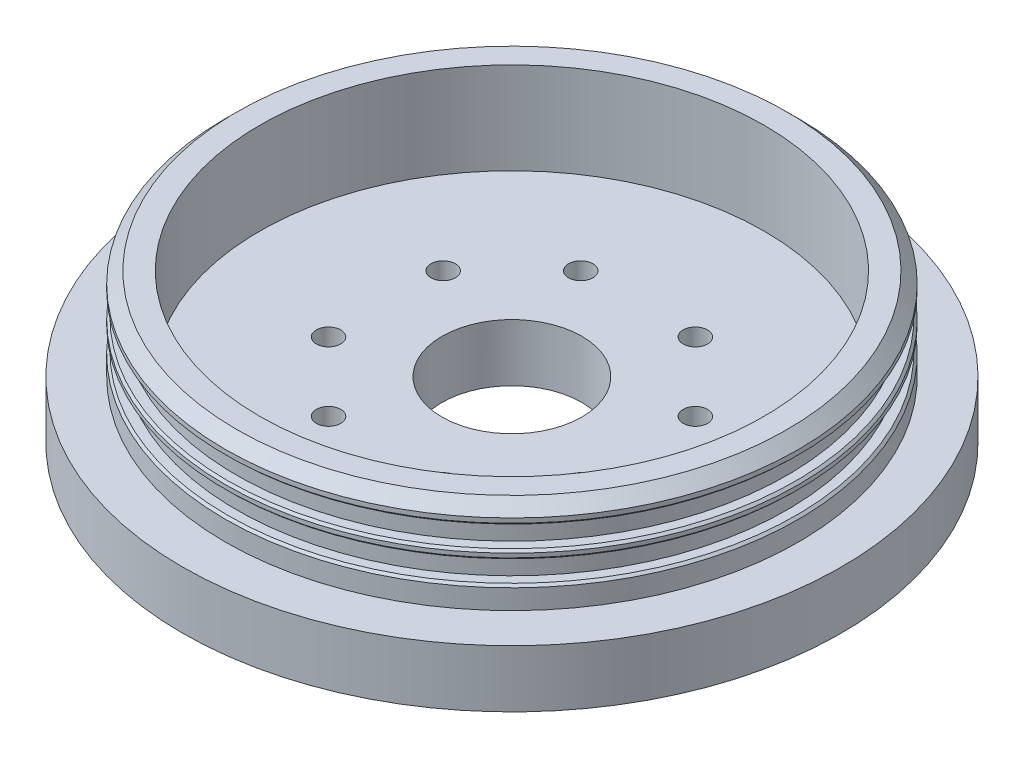
ISO-10303-21;
HEADER;
FILE_DESCRIPTION(('STEP AP214'),'2;1');
FILE_NAME('part.step','',(''),(''),'','','');
FILE_SCHEMA(('AUTOMOTIVE_DESIGN { 1 0 10303 214 1 1 1 1 }'));
ENDSEC;
DATA;
#1=APPLICATION_CONTEXT('core data for automotive mechanical design processes');
#2=APPLICATION_PROTOCOL_DEFINITION('international standard','automotive_design',2000,#1);
#3=PRODUCT_CONTEXT('',#1,'mechanical');
#4=PRODUCT('Part','Part','',(#3));
#5=PRODUCT_RELATED_PRODUCT_CATEGORY('part','',(#4));
#6=PRODUCT_DEFINITION_FORMATION('','',#4);
#7=PRODUCT_DEFINITION_CONTEXT('part definition',#1,'design');
#8=PRODUCT_DEFINITION('design','',#6,#7);
#9=PRODUCT_DEFINITION_SHAPE('','',#8);
#10=(LENGTH_UNIT() NAMED_UNIT(*) SI_UNIT(.MILLI.,.METRE.));
#11=(NAMED_UNIT(*) PLANE_ANGLE_UNIT() SI_UNIT($,.RADIAN.));
#12=(NAMED_UNIT(*) SI_UNIT($,.STERADIAN.) SOLID_ANGLE_UNIT());
#13=UNCERTAINTY_MEASURE_WITH_UNIT(LENGTH_MEASURE(1.E-05),#10,'distance_accuracy_value','');
#14=(GEOMETRIC_REPRESENTATION_CONTEXT(3) GLOBAL_UNCERTAINTY_ASSIGNED_CONTEXT((#13)) GLOBAL_UNIT_ASSIGNED_CONTEXT((#10,
#11,#12)) REPRESENTATION_CONTEXT('',''));
#15=CARTESIAN_POINT('',(0.,0.,0.));
#16=DIRECTION('',(0.,0.,1.));
#17=DIRECTION('',(1.,0.,0.));
#18=AXIS2_PLACEMENT_3D('',#15,#16,#17);
#19=CARTESIAN_POINT('',(0.,13.335,0.));
#20=DIRECTION('',(0.,-1.,0.));
#21=DIRECTION('',(0.,0.,-1.));
#22=AXIS2_PLACEMENT_3D('',#19,#20,#21);
#23=CYLINDRICAL_SURFACE('',#22,31.75);
#24=CARTESIAN_POINT('',(0.,8.2350684242944,0.));
#25=DIRECTION('',(0.,-1.,0.));
#26=DIRECTION('',(0.,0.,-1.));
#27=AXIS2_PLACEMENT_3D('',#24,#25,#26);
#28=CIRCLE('',#27,31.75);
#29=CARTESIAN_POINT('',(0.,8.2350684242944,-31.75));
#30=VERTEX_POINT('',#29);
#31=EDGE_CURVE('E42',#30,#30,#28,.F.);
#32=ORIENTED_EDGE('',*,*,#31,.T.);
#33=EDGE_LOOP('',(#32));
#34=FACE_BOUND('',#33,.T.);
#35=CARTESIAN_POINT('',(0.,8.68721080125111,0.));
#36=DIRECTION('',(0.,1.,0.));
#37=DIRECTION('',(0.,0.,1.));
#38=AXIS2_PLACEMENT_3D('',#35,#36,#37);
#39=CIRCLE('',#38,31.75);
#40=CARTESIAN_POINT('',(0.,8.68721080125111,31.75));
#41=VERTEX_POINT('',#40);
#42=EDGE_CURVE('E178',#41,#41,#39,.F.);
#43=ORIENTED_EDGE('',*,*,#42,.T.);
#44=EDGE_LOOP('',(#43));
#45=FACE_BOUND('',#44,.T.);
#46=ADVANCED_FACE('F34',(#34,#45),#23,.T.);
#47=CARTESIAN_POINT('',(0.,8.9412108012511,31.75));
#48=DIRECTION('',(0.,1.,0.));
#49=DIRECTION('',(0.,0.,1.));
#50=AXIS2_PLACEMENT_3D('',#47,#48,#49);
#51=PLANE('',#50);
#52=CARTESIAN_POINT('',(0.,8.9412108012511,0.));
#53=DIRECTION('',(0.,1.,0.));
#54=DIRECTION('',(0.,0.,1.));
#55=AXIS2_PLACEMENT_3D('',#52,#53,#54);
#56=CIRCLE('',#55,31.496);
#57=CARTESIAN_POINT('',(0.,8.9412108012511,31.496));
#58=VERTEX_POINT('',#57);
#59=EDGE_CURVE('E11',#58,#58,#56,.T.);
#60=ORIENTED_EDGE('',*,*,#59,.T.);
#61=EDGE_LOOP('',(#60));
#62=FACE_BOUND('',#61,.T.);
#63=CARTESIAN_POINT('',(0.,8.9412108012511,0.));
#64=DIRECTION('',(0.,-1.,0.));
#65=DIRECTION('',(0.,0.,-1.));
#66=AXIS2_PLACEMENT_3D('',#63,#64,#65);
#67=CIRCLE('',#66,30.48);
#68=CARTESIAN_POINT('',(0.,8.9412108012511,-30.48));
#69=VERTEX_POINT('',#68);
#70=EDGE_CURVE('E143',#69,#69,#67,.T.);
#71=ORIENTED_EDGE('',*,*,#70,.T.);
#72=EDGE_LOOP('',(#71));
#73=FACE_BOUND('',#72,.T.);
#74=ADVANCED_FACE('F218',(#62,#73),#51,.T.);
#75=CARTESIAN_POINT('',(0.,-3.175,0.));
#76=DIRECTION('',(0.,-1.,0.));
#77=DIRECTION('',(0.,0.,-1.));
#78=AXIS2_PLACEMENT_3D('',#75,#76,#77);
#79=CYLINDRICAL_SURFACE('',#78,30.48);
#80=CARTESIAN_POINT('',(0.,11.3034108012511,0.));
#81=DIRECTION('',(0.,-1.,0.));
#82=DIRECTION('',(0.,0.,-1.));
#83=AXIS2_PLACEMENT_3D('',#80,#81,#82);
#84=CIRCLE('',#83,30.48);
#85=CARTESIAN_POINT('',(0.,11.3034108012511,-30.48));
#86=VERTEX_POINT('',#85);
#87=EDGE_CURVE('E140',#86,#86,#84,.T.);
#88=ORIENTED_EDGE('',*,*,#87,.T.);
#89=EDGE_LOOP('',(#88));
#90=FACE_BOUND('',#89,.T.);
#91=ORIENTED_EDGE('',*,*,#70,.F.);
#92=EDGE_LOOP('',(#91));
#93=FACE_BOUND('',#92,.T.);
#94=ADVANCED_FACE('F222',(#90,#93),#79,.T.);
#95=CARTESIAN_POINT('',(0.,11.3034108012511,31.75));
#96=DIRECTION('',(0.,-1.,0.));
#97=DIRECTION('',(0.,0.,-1.));
#98=AXIS2_PLACEMENT_3D('',#95,#96,#97);
#99=PLANE('',#98);
#100=CARTESIAN_POINT('',(0.,11.3034108012511,0.));
#101=DIRECTION('',(0.,-1.,0.));
#102=DIRECTION('',(0.,0.,-1.));
#103=AXIS2_PLACEMENT_3D('',#100,#101,#102);
#104=CIRCLE('',#103,31.496);
#105=CARTESIAN_POINT('',(0.,11.3034108012511,-31.496));
#106=VERTEX_POINT('',#105);
#107=EDGE_CURVE('E161',#106,#106,#104,.T.);
#108=ORIENTED_EDGE('',*,*,#107,.T.);
#109=EDGE_LOOP('',(#108));
#110=FACE_BOUND('',#109,.T.);
#111=ORIENTED_EDGE('',*,*,#87,.F.);
#112=EDGE_LOOP('',(#111));
#113=FACE_BOUND('',#112,.T.);
#114=ADVANCED_FACE('F309',(#110,#113),#99,.T.);
#115=CARTESIAN_POINT('',(0.,13.335,0.));
#116=DIRECTION('',(0.,1.,0.));
#117=DIRECTION('',(0.,0.,1.));
#118=AXIS2_PLACEMENT_3D('',#115,#116,#117);
#119=PLANE('',#118);
#120=CARTESIAN_POINT('',(0.,13.335,0.));
#121=DIRECTION('',(0.,1.,0.));
#122=DIRECTION('',(0.,0.,1.));
#123=AXIS2_PLACEMENT_3D('',#120,#121,#122);
#124=CIRCLE('',#123,30.48);
#125=CARTESIAN_POINT('',(0.,13.335,30.48));
#126=VERTEX_POINT('',#125);
#127=EDGE_CURVE('E155',#126,#126,#124,.T.);
#128=ORIENTED_EDGE('',*,*,#127,.T.);
#129=EDGE_LOOP('',(#128));
#130=FACE_BOUND('',#129,.T.);
#131=CARTESIAN_POINT('',(0.,13.335,0.));
#132=DIRECTION('',(0.,1.,0.));
#133=DIRECTION('',(0.,0.,1.));
#134=AXIS2_PLACEMENT_3D('',#131,#132,#133);
#135=CIRCLE('',#134,27.94);
#136=CARTESIAN_POINT('',(0.,13.335,27.94));
#137=VERTEX_POINT('',#136);
#138=EDGE_CURVE('E132',#137,#137,#135,.T.);
#139=ORIENTED_EDGE('',*,*,#138,.F.);
#140=EDGE_LOOP('',(#139));
#141=FACE_BOUND('',#140,.T.);
#142=ADVANCED_FACE('F212',(#130,#141),#119,.T.);
#143=CARTESIAN_POINT('',(0.,11.5574108012511,0.));
#144=DIRECTION('',(0.,-1.,0.));
#145=DIRECTION('',(0.,0.,-1.));
#146=AXIS2_PLACEMENT_3D('',#143,#144,#145);
#147=CIRCLE('',#146,31.75);
#148=CARTESIAN_POINT('',(0.,11.5574108012511,-31.75));
#149=VERTEX_POINT('',#148);
#150=EDGE_CURVE('E166',#149,#149,#147,.F.);
#151=ORIENTED_EDGE('',*,*,#150,.T.);
#152=EDGE_LOOP('',(#151));
#153=FACE_BOUND('',#152,.T.);
#154=CARTESIAN_POINT('',(0.,12.065,0.));
#155=DIRECTION('',(0.,1.,0.));
#156=DIRECTION('',(0.,0.,1.));
#157=AXIS2_PLACEMENT_3D('',#154,#155,#156);
#158=CIRCLE('',#157,31.75);
#159=CARTESIAN_POINT('',(0.,12.065,31.75));
#160=VERTEX_POINT('',#159);
#161=EDGE_CURVE('E158',#160,#160,#158,.F.);
#162=ORIENTED_EDGE('',*,*,#161,.T.);
#163=EDGE_LOOP('',(#162));
#164=FACE_BOUND('',#163,.T.);
#165=ADVANCED_FACE('F206',(#153,#164),#23,.T.);
#166=CARTESIAN_POINT('',(0.,5.61886842429443,31.75));
#167=DIRECTION('',(0.,1.,0.));
#168=DIRECTION('',(0.,0.,1.));
#169=AXIS2_PLACEMENT_3D('',#166,#167,#168);
#170=PLANE('',#169);
#171=CARTESIAN_POINT('',(0.,5.61886842429443,0.));
#172=DIRECTION('',(0.,1.,0.));
#173=DIRECTION('',(0.,0.,1.));
#174=AXIS2_PLACEMENT_3D('',#171,#172,#173);
#175=CIRCLE('',#174,31.496);
#176=CARTESIAN_POINT('',(0.,5.61886842429443,31.496));
#177=VERTEX_POINT('',#176);
#178=EDGE_CURVE('E172',#177,#177,#175,.T.);
#179=ORIENTED_EDGE('',*,*,#178,.T.);
#180=EDGE_LOOP('',(#179));
#181=FACE_BOUND('',#180,.T.);
#182=CARTESIAN_POINT('',(0.,5.61886842429443,0.));
#183=DIRECTION('',(0.,-1.,0.));
#184=DIRECTION('',(0.,0.,-1.));
#185=AXIS2_PLACEMENT_3D('',#182,#183,#184);
#186=CIRCLE('',#185,30.48);
#187=CARTESIAN_POINT('',(0.,5.61886842429443,-30.48));
#188=VERTEX_POINT('',#187);
#189=EDGE_CURVE('E137',#188,#188,#186,.T.);
#190=ORIENTED_EDGE('',*,*,#189,.T.);
#191=EDGE_LOOP('',(#190));
#192=FACE_BOUND('',#191,.T.);
#193=ADVANCED_FACE('F201',(#181,#192),#170,.T.);
#194=CARTESIAN_POINT('',(0.,-3.175,0.));
#195=DIRECTION('',(0.,-1.,0.));
#196=DIRECTION('',(0.,0.,-1.));
#197=AXIS2_PLACEMENT_3D('',#194,#195,#196);
#198=CYLINDRICAL_SURFACE('',#197,30.48);
#199=CARTESIAN_POINT('',(0.,7.98106842429442,0.));
#200=DIRECTION('',(0.,-1.,0.));
#201=DIRECTION('',(0.,0.,-1.));
#202=AXIS2_PLACEMENT_3D('',#199,#200,#201);
#203=CIRCLE('',#202,30.48);
#204=CARTESIAN_POINT('',(0.,7.98106842429442,-30.48));
#205=VERTEX_POINT('',#204);
#206=EDGE_CURVE('E131',#205,#205,#203,.T.);
#207=ORIENTED_EDGE('',*,*,#206,.T.);
#208=EDGE_LOOP('',(#207));
#209=FACE_BOUND('',#208,.T.);
#210=ORIENTED_EDGE('',*,*,#189,.F.);
#211=EDGE_LOOP('',(#210));
#212=FACE_BOUND('',#211,.T.);
#213=ADVANCED_FACE('F195',(#209,#212),#198,.T.);
#214=CARTESIAN_POINT('',(0.,7.98106842429442,31.75));
#215=DIRECTION('',(0.,-1.,0.));
#216=DIRECTION('',(0.,0.,-1.));
#217=AXIS2_PLACEMENT_3D('',#214,#215,#216);
#218=PLANE('',#217);
#219=CARTESIAN_POINT('',(0.,7.98106842429442,0.));
#220=DIRECTION('',(0.,-1.,0.));
#221=DIRECTION('',(0.,0.,-1.));
#222=AXIS2_PLACEMENT_3D('',#219,#220,#221);
#223=CIRCLE('',#222,31.496);
#224=CARTESIAN_POINT('',(0.,7.98106842429442,-31.496));
#225=VERTEX_POINT('',#224);
#226=EDGE_CURVE('E175',#225,#225,#223,.T.);
#227=ORIENTED_EDGE('',*,*,#226,.T.);
#228=EDGE_LOOP('',(#227));
#229=FACE_BOUND('',#228,.T.);
#230=ORIENTED_EDGE('',*,*,#206,.F.);
#231=EDGE_LOOP('',(#230));
#232=FACE_BOUND('',#231,.T.);
#233=ADVANCED_FACE('F191',(#229,#232),#218,.T.);
#234=CARTESIAN_POINT('',(0.,-3.175,0.));
#235=DIRECTION('',(0.,1.,0.));
#236=DIRECTION('',(0.,0.,1.));
#237=AXIS2_PLACEMENT_3D('',#234,#235,#236);
#238=PLANE('',#237);
#239=CARTESIAN_POINT('',(0.,-3.175,0.));
#240=DIRECTION('',(0.,-1.,0.));
#241=DIRECTION('',(0.,0.,-1.));
#242=AXIS2_PLACEMENT_3D('',#239,#240,#241);
#243=CIRCLE('',#242,7.74999999999996);
#244=CARTESIAN_POINT('',(0.,-3.175,-7.74999999999996));
#245=VERTEX_POINT('',#244);
#246=EDGE_CURVE('E124',#245,#245,#243,.T.);
#247=ORIENTED_EDGE('',*,*,#246,.F.);
#248=EDGE_LOOP('',(#247));
#249=FACE_BOUND('',#248,.T.);
#250=CARTESIAN_POINT('',(0.,-3.175,0.));
#251=DIRECTION('',(0.,1.,0.));
#252=DIRECTION('',(0.,0.,1.));
#253=AXIS2_PLACEMENT_3D('',#250,#251,#252);
#254=CIRCLE('',#253,36.5125);
#255=CARTESIAN_POINT('',(0.,-3.175,36.5125));
#256=VERTEX_POINT('',#255);
#257=EDGE_CURVE('E149',#256,#256,#254,.T.);
#258=ORIENTED_EDGE('',*,*,#257,.F.);
#259=EDGE_LOOP('',(#258));
#260=FACE_BOUND('',#259,.T.);
#261=ADVANCED_FACE('F194',(#249,#260),#238,.F.);
#262=CARTESIAN_POINT('',(0.,3.175,0.));
#263=DIRECTION('',(0.,-1.,0.));
#264=DIRECTION('',(0.,0.,-1.));
#265=AXIS2_PLACEMENT_3D('',#262,#263,#264);
#266=CYLINDRICAL_SURFACE('',#265,36.5125);
#267=CARTESIAN_POINT('',(0.,3.175,0.));
#268=DIRECTION('',(0.,1.,0.));
#269=DIRECTION('',(0.,0.,1.));
#270=AXIS2_PLACEMENT_3D('',#267,#268,#269);
#271=CIRCLE('',#270,36.5125);
#272=CARTESIAN_POINT('',(0.,3.175,36.5125));
#273=VERTEX_POINT('',#272);
#274=EDGE_CURVE('E152',#273,#273,#271,.T.);
#275=ORIENTED_EDGE('',*,*,#274,.F.);
#276=EDGE_LOOP('',(#275));
#277=FACE_BOUND('',#276,.T.);
#278=ORIENTED_EDGE('',*,*,#257,.T.);
#279=EDGE_LOOP('',(#278));
#280=FACE_BOUND('',#279,.T.);
#281=ADVANCED_FACE('F238',(#277,#280),#266,.T.);
#282=CARTESIAN_POINT('',(0.,3.175,0.));
#283=DIRECTION('',(0.,1.,0.));
#284=DIRECTION('',(0.,0.,1.));
#285=AXIS2_PLACEMENT_3D('',#282,#283,#284);
#286=PLANE('',#285);
#287=ORIENTED_EDGE('',*,*,#274,.T.);
#288=EDGE_LOOP('',(#287));
#289=FACE_BOUND('',#288,.T.);
#290=CARTESIAN_POINT('',(0.,3.175,0.));
#291=DIRECTION('',(0.,1.,0.));
#292=DIRECTION('',(0.,0.,1.));
#293=AXIS2_PLACEMENT_3D('',#290,#291,#292);
#294=CIRCLE('',#293,31.75);
#295=CARTESIAN_POINT('',(0.,3.175,31.75));
#296=VERTEX_POINT('',#295);
#297=EDGE_CURVE('E146',#296,#296,#294,.T.);
#298=ORIENTED_EDGE('',*,*,#297,.F.);
#299=EDGE_LOOP('',(#298));
#300=FACE_BOUND('',#299,.T.);
#301=ADVANCED_FACE('F229',(#289,#300),#286,.T.);
#302=CARTESIAN_POINT('',(0.,5.36486842429443,0.));
#303=DIRECTION('',(0.,1.,0.));
#304=DIRECTION('',(0.,0.,1.));
#305=AXIS2_PLACEMENT_3D('',#302,#303,#304);
#306=CIRCLE('',#305,31.75);
#307=CARTESIAN_POINT('',(0.,5.36486842429443,31.75));
#308=VERTEX_POINT('',#307);
#309=EDGE_CURVE('E169',#308,#308,#306,.F.);
#310=ORIENTED_EDGE('',*,*,#309,.T.);
#311=EDGE_LOOP('',(#310));
#312=FACE_BOUND('',#311,.T.);
#313=ORIENTED_EDGE('',*,*,#297,.T.);
#314=EDGE_LOOP('',(#313));
#315=FACE_BOUND('',#314,.T.);
#316=ADVANCED_FACE('F215',(#312,#315),#23,.T.);
#317=CARTESIAN_POINT('',(0.,3.175,0.));
#318=DIRECTION('',(0.,1.,0.));
#319=DIRECTION('',(0.,0.,1.));
#320=AXIS2_PLACEMENT_3D('',#317,#318,#319);
#321=CYLINDRICAL_SURFACE('',#320,27.94);
#322=CARTESIAN_POINT('',(0.,3.175,0.));
#323=DIRECTION('',(0.,1.,0.));
#324=DIRECTION('',(0.,0.,1.));
#325=AXIS2_PLACEMENT_3D('',#322,#323,#324);
#326=CIRCLE('',#325,27.94);
#327=CARTESIAN_POINT('',(0.,3.175,27.94));
#328=VERTEX_POINT('',#327);
#329=EDGE_CURVE('E128',#328,#328,#326,.T.);
#330=ORIENTED_EDGE('',*,*,#329,.F.);
#331=EDGE_LOOP('',(#330));
#332=FACE_BOUND('',#331,.T.);
#333=ORIENTED_EDGE('',*,*,#138,.T.);
#334=EDGE_LOOP('',(#333));
#335=FACE_BOUND('',#334,.T.);
#336=ADVANCED_FACE('F228',(#332,#335),#321,.F.);
#337=CARTESIAN_POINT('',(0.,3.175,0.));
#338=DIRECTION('',(0.,1.,0.));
#339=DIRECTION('',(0.,0.,1.));
#340=AXIS2_PLACEMENT_3D('',#337,#338,#339);
#341=PLANE('',#340);
#342=CARTESIAN_POINT('',(-6.35,3.175,13.97));
#343=DIRECTION('',(0.,1.,0.));
#344=DIRECTION('',(0.,0.,1.));
#345=AXIS2_PLACEMENT_3D('',#342,#343,#344);
#346=CIRCLE('',#345,1.35255);
#347=CARTESIAN_POINT('',(-6.35,3.175,15.32255));
#348=VERTEX_POINT('',#347);
#349=EDGE_CURVE('E78',#348,#348,#346,.T.);
#350=ORIENTED_EDGE('',*,*,#349,.F.);
#351=EDGE_LOOP('',(#350));
#352=FACE_BOUND('',#351,.T.);
#353=CARTESIAN_POINT('',(6.35,3.175,13.97));
#354=DIRECTION('',(0.,1.,0.));
#355=DIRECTION('',(0.,0.,1.));
#356=AXIS2_PLACEMENT_3D('',#353,#354,#355);
#357=CIRCLE('',#356,1.35255);
#358=CARTESIAN_POINT('',(6.35,3.175,15.32255));
#359=VERTEX_POINT('',#358);
#360=EDGE_CURVE('E77',#359,#359,#357,.T.);
#361=ORIENTED_EDGE('',*,*,#360,.F.);
#362=EDGE_LOOP('',(#361));
#363=FACE_BOUND('',#362,.T.);
#364=CARTESIAN_POINT('',(13.97,3.175,6.35));
#365=DIRECTION('',(0.,1.,0.));
#366=DIRECTION('',(0.,0.,1.));
#367=AXIS2_PLACEMENT_3D('',#364,#365,#366);
#368=CIRCLE('',#367,1.35255);
#369=CARTESIAN_POINT('',(13.97,3.175,7.70255));
#370=VERTEX_POINT('',#369);
#371=EDGE_CURVE('E88',#370,#370,#368,.T.);
#372=ORIENTED_EDGE('',*,*,#371,.F.);
#373=EDGE_LOOP('',(#372));
#374=FACE_BOUND('',#373,.T.);
#375=CARTESIAN_POINT('',(13.97,3.175,-6.35));
#376=DIRECTION('',(0.,1.,0.));
#377=DIRECTION('',(0.,0.,1.));
#378=AXIS2_PLACEMENT_3D('',#375,#376,#377);
#379=CIRCLE('',#378,1.35255);
#380=CARTESIAN_POINT('',(13.97,3.175,-4.99745));
#381=VERTEX_POINT('',#380);
#382=EDGE_CURVE('E94',#381,#381,#379,.T.);
#383=ORIENTED_EDGE('',*,*,#382,.F.);
#384=EDGE_LOOP('',(#383));
#385=FACE_BOUND('',#384,.T.);
#386=CARTESIAN_POINT('',(6.35,3.175,-13.97));
#387=DIRECTION('',(0.,1.,0.));
#388=DIRECTION('',(0.,0.,1.));
#389=AXIS2_PLACEMENT_3D('',#386,#387,#388);
#390=CIRCLE('',#389,1.35255);
#391=CARTESIAN_POINT('',(6.35,3.175,-12.61745));
#392=VERTEX_POINT('',#391);
#393=EDGE_CURVE('E100',#392,#392,#390,.T.);
#394=ORIENTED_EDGE('',*,*,#393,.F.);
#395=EDGE_LOOP('',(#394));
#396=FACE_BOUND('',#395,.T.);
#397=CARTESIAN_POINT('',(-6.35,3.175,-13.97));
#398=DIRECTION('',(0.,1.,0.));
#399=DIRECTION('',(0.,0.,1.));
#400=AXIS2_PLACEMENT_3D('',#397,#398,#399);
#401=CIRCLE('',#400,1.35255);
#402=CARTESIAN_POINT('',(-6.35,3.175,-12.61745));
#403=VERTEX_POINT('',#402);
#404=EDGE_CURVE('E106',#403,#403,#401,.T.);
#405=ORIENTED_EDGE('',*,*,#404,.F.);
#406=EDGE_LOOP('',(#405));
#407=FACE_BOUND('',#406,.T.);
#408=CARTESIAN_POINT('',(-13.97,3.175,-6.35));
#409=DIRECTION('',(0.,1.,0.));
#410=DIRECTION('',(0.,0.,1.));
#411=AXIS2_PLACEMENT_3D('',#408,#409,#410);
#412=CIRCLE('',#411,1.35255);
#413=CARTESIAN_POINT('',(-13.97,3.175,-4.99745));
#414=VERTEX_POINT('',#413);
#415=EDGE_CURVE('E112',#414,#414,#412,.T.);
#416=ORIENTED_EDGE('',*,*,#415,.F.);
#417=EDGE_LOOP('',(#416));
#418=FACE_BOUND('',#417,.T.);
#419=CARTESIAN_POINT('',(-13.97,3.175,6.35));
#420=DIRECTION('',(0.,1.,0.));
#421=DIRECTION('',(0.,0.,1.));
#422=AXIS2_PLACEMENT_3D('',#419,#420,#421);
#423=CIRCLE('',#422,1.35255);
#424=CARTESIAN_POINT('',(-13.97,3.175,7.70255));
#425=VERTEX_POINT('',#424);
#426=EDGE_CURVE('E118',#425,#425,#423,.T.);
#427=ORIENTED_EDGE('',*,*,#426,.F.);
#428=EDGE_LOOP('',(#427));
#429=FACE_BOUND('',#428,.T.);
#430=CARTESIAN_POINT('',(0.,3.175,0.));
#431=DIRECTION('',(0.,1.,0.));
#432=DIRECTION('',(0.,0.,1.));
#433=AXIS2_PLACEMENT_3D('',#430,#431,#432);
#434=CIRCLE('',#433,7.74999999999994);
#435=CARTESIAN_POINT('',(0.,3.175,7.74999999999994));
#436=VERTEX_POINT('',#435);
#437=EDGE_CURVE('E127',#436,#436,#434,.T.);
#438=ORIENTED_EDGE('',*,*,#437,.F.);
#439=EDGE_LOOP('',(#438));
#440=FACE_BOUND('',#439,.T.);
#441=ORIENTED_EDGE('',*,*,#329,.T.);
#442=EDGE_LOOP('',(#441));
#443=FACE_BOUND('',#442,.T.);
#444=ADVANCED_FACE('F235',(#352,#363,#374,#385,#396,#407,#418,#429,#440,#443),#341,.T.);
#445=CARTESIAN_POINT('',(0.,13.335,0.));
#446=DIRECTION('',(0.,-1.,0.));
#447=DIRECTION('',(0.,0.,-1.));
#448=AXIS2_PLACEMENT_3D('',#445,#446,#447);
#449=CONICAL_SURFACE('',#448,30.48,0.785398163397443);
#450=ORIENTED_EDGE('',*,*,#161,.F.);
#451=EDGE_LOOP('',(#450));
#452=FACE_BOUND('',#451,.T.);
#453=ORIENTED_EDGE('',*,*,#127,.F.);
#454=EDGE_LOOP('',(#453));
#455=FACE_BOUND('',#454,.T.);
#456=ADVANCED_FACE('F258',(#452,#455),#449,.T.);
#457=CARTESIAN_POINT('',(0.,-3.175,0.));
#458=DIRECTION('',(0.,-1.,0.));
#459=DIRECTION('',(0.,0.,-1.));
#460=AXIS2_PLACEMENT_3D('',#457,#458,#459);
#461=CYLINDRICAL_SURFACE('',#460,7.74999999999994);
#462=ORIENTED_EDGE('',*,*,#437,.T.);
#463=EDGE_LOOP('',(#462));
#464=FACE_BOUND('',#463,.T.);
#465=ORIENTED_EDGE('',*,*,#246,.T.);
#466=EDGE_LOOP('',(#465));
#467=FACE_BOUND('',#466,.T.);
#468=ADVANCED_FACE('F253',(#464,#467),#461,.F.);
#469=CARTESIAN_POINT('',(0.,11.3034108012511,0.));
#470=DIRECTION('',(0.,1.,0.));
#471=DIRECTION('',(0.,0.,1.));
#472=AXIS2_PLACEMENT_3D('',#469,#470,#471);
#473=CONICAL_SURFACE('',#472,31.496,0.785398163397435);
#474=ORIENTED_EDGE('',*,*,#150,.F.);
#475=EDGE_LOOP('',(#474));
#476=FACE_BOUND('',#475,.T.);
#477=ORIENTED_EDGE('',*,*,#107,.F.);
#478=EDGE_LOOP('',(#477));
#479=FACE_BOUND('',#478,.T.);
#480=ADVANCED_FACE('F247',(#476,#479),#473,.T.);
#481=CARTESIAN_POINT('',(0.,5.36486842429443,0.));
#482=DIRECTION('',(0.,-1.,0.));
#483=DIRECTION('',(0.,0.,-1.));
#484=AXIS2_PLACEMENT_3D('',#481,#482,#483);
#485=CONICAL_SURFACE('',#484,31.75,0.785398163397435);
#486=ORIENTED_EDGE('',*,*,#178,.F.);
#487=EDGE_LOOP('',(#486));
#488=FACE_BOUND('',#487,.T.);
#489=ORIENTED_EDGE('',*,*,#309,.F.);
#490=EDGE_LOOP('',(#489));
#491=FACE_BOUND('',#490,.T.);
#492=ADVANCED_FACE('F188',(#488,#491),#485,.T.);
#493=CARTESIAN_POINT('',(0.,7.98106842429442,0.));
#494=DIRECTION('',(0.,1.,0.));
#495=DIRECTION('',(0.,0.,1.));
#496=AXIS2_PLACEMENT_3D('',#493,#494,#495);
#497=CONICAL_SURFACE('',#496,31.496,0.785398163397489);
#498=ORIENTED_EDGE('',*,*,#31,.F.);
#499=EDGE_LOOP('',(#498));
#500=FACE_BOUND('',#499,.T.);
#501=ORIENTED_EDGE('',*,*,#226,.F.);
#502=EDGE_LOOP('',(#501));
#503=FACE_BOUND('',#502,.T.);
#504=ADVANCED_FACE('F185',(#500,#503),#497,.T.);
#505=CARTESIAN_POINT('',(0.,8.68721080125111,0.));
#506=DIRECTION('',(0.,-1.,0.));
#507=DIRECTION('',(0.,0.,-1.));
#508=AXIS2_PLACEMENT_3D('',#505,#506,#507);
#509=CONICAL_SURFACE('',#508,31.75,0.785398163397462);
#510=ORIENTED_EDGE('',*,*,#59,.F.);
#511=EDGE_LOOP('',(#510));
#512=FACE_BOUND('',#511,.T.);
#513=ORIENTED_EDGE('',*,*,#42,.F.);
#514=EDGE_LOOP('',(#513));
#515=FACE_BOUND('',#514,.T.);
#516=ADVANCED_FACE('F36',(#512,#515),#509,.T.);
#517=CARTESIAN_POINT('',(-13.97,-0.127000000000001,6.35));
#518=DIRECTION('',(0.,1.,0.));
#519=DIRECTION('',(0.,0.,1.));
#520=AXIS2_PLACEMENT_3D('',#517,#518,#519);
#521=CONICAL_SURFACE('',#520,1.35255,1.02974425867665);
#522=CARTESIAN_POINT('',(-13.97,-0.939694030265728,6.35));
#523=VERTEX_POINT('',#522);
#524=VERTEX_LOOP('',#523);
#525=FACE_BOUND('',#524,.T.);
#526=CARTESIAN_POINT('',(-13.97,-0.127000000000001,6.35));
#527=DIRECTION('',(0.,1.,0.));
#528=DIRECTION('',(0.,0.,1.));
#529=AXIS2_PLACEMENT_3D('',#526,#527,#528);
#530=CIRCLE('',#529,1.35255);
#531=CARTESIAN_POINT('',(-13.97,-0.127000000000001,7.70255));
#532=VERTEX_POINT('',#531);
#533=EDGE_CURVE('E121',#532,#532,#530,.T.);
#534=ORIENTED_EDGE('',*,*,#533,.T.);
#535=EDGE_LOOP('',(#534));
#536=FACE_BOUND('',#535,.T.);
#537=ADVANCED_FACE('F280',(#525,#536),#521,.F.);
#538=CARTESIAN_POINT('',(-13.97,3.175,6.35));
#539=DIRECTION('',(0.,1.,0.));
#540=DIRECTION('',(0.,0.,1.));
#541=AXIS2_PLACEMENT_3D('',#538,#539,#540);
#542=CYLINDRICAL_SURFACE('',#541,1.35255);
#543=ORIENTED_EDGE('',*,*,#533,.F.);
#544=EDGE_LOOP('',(#543));
#545=FACE_BOUND('',#544,.T.);
#546=ORIENTED_EDGE('',*,*,#426,.T.);
#547=EDGE_LOOP('',(#546));
#548=FACE_BOUND('',#547,.T.);
#549=ADVANCED_FACE('F398',(#545,#548),#542,.F.);
#550=CARTESIAN_POINT('',(-13.97,-0.127000000000001,-6.35));
#551=DIRECTION('',(0.,1.,0.));
#552=DIRECTION('',(0.,0.,1.));
#553=AXIS2_PLACEMENT_3D('',#550,#551,#552);
#554=CONICAL_SURFACE('',#553,1.35255,1.02974425867665);
#555=CARTESIAN_POINT('',(-13.97,-0.939694030265728,-6.35));
#556=VERTEX_POINT('',#555);
#557=VERTEX_LOOP('',#556);
#558=FACE_BOUND('',#557,.T.);
#559=CARTESIAN_POINT('',(-13.97,-0.127000000000001,-6.35));
#560=DIRECTION('',(0.,1.,0.));
#561=DIRECTION('',(0.,0.,1.));
#562=AXIS2_PLACEMENT_3D('',#559,#560,#561);
#563=CIRCLE('',#562,1.35255);
#564=CARTESIAN_POINT('',(-13.97,-0.127000000000001,-4.99745));
#565=VERTEX_POINT('',#564);
#566=EDGE_CURVE('E115',#565,#565,#563,.T.);
#567=ORIENTED_EDGE('',*,*,#566,.T.);
#568=EDGE_LOOP('',(#567));
#569=FACE_BOUND('',#568,.T.);
#570=ADVANCED_FACE('F406',(#558,#569),#554,.F.);
#571=CARTESIAN_POINT('',(-13.97,3.175,-6.35));
#572=DIRECTION('',(0.,1.,0.));
#573=DIRECTION('',(0.,0.,1.));
#574=AXIS2_PLACEMENT_3D('',#571,#572,#573);
#575=CYLINDRICAL_SURFACE('',#574,1.35255);
#576=ORIENTED_EDGE('',*,*,#566,.F.);
#577=EDGE_LOOP('',(#576));
#578=FACE_BOUND('',#577,.T.);
#579=ORIENTED_EDGE('',*,*,#415,.T.);
#580=EDGE_LOOP('',(#579));
#581=FACE_BOUND('',#580,.T.);
#582=ADVANCED_FACE('F415',(#578,#581),#575,.F.);
#583=CARTESIAN_POINT('',(-6.35,-0.127000000000001,-13.97));
#584=DIRECTION('',(0.,1.,0.));
#585=DIRECTION('',(0.,0.,1.));
#586=AXIS2_PLACEMENT_3D('',#583,#584,#585);
#587=CONICAL_SURFACE('',#586,1.35255,1.02974425867665);
#588=CARTESIAN_POINT('',(-6.35,-0.939694030265728,-13.97));
#589=VERTEX_POINT('',#588);
#590=VERTEX_LOOP('',#589);
#591=FACE_BOUND('',#590,.T.);
#592=CARTESIAN_POINT('',(-6.35,-0.127000000000001,-13.97));
#593=DIRECTION('',(0.,1.,0.));
#594=DIRECTION('',(0.,0.,1.));
#595=AXIS2_PLACEMENT_3D('',#592,#593,#594);
#596=CIRCLE('',#595,1.35255);
#597=CARTESIAN_POINT('',(-6.35,-0.127000000000001,-12.61745));
#598=VERTEX_POINT('',#597);
#599=EDGE_CURVE('E109',#598,#598,#596,.T.);
#600=ORIENTED_EDGE('',*,*,#599,.T.);
#601=EDGE_LOOP('',(#600));
#602=FACE_BOUND('',#601,.T.);
#603=ADVANCED_FACE('F424',(#591,#602),#587,.F.);
#604=CARTESIAN_POINT('',(-6.35,3.175,-13.97));
#605=DIRECTION('',(0.,1.,0.));
#606=DIRECTION('',(0.,0.,1.));
#607=AXIS2_PLACEMENT_3D('',#604,#605,#606);
#608=CYLINDRICAL_SURFACE('',#607,1.35255);
#609=ORIENTED_EDGE('',*,*,#599,.F.);
#610=EDGE_LOOP('',(#609));
#611=FACE_BOUND('',#610,.T.);
#612=ORIENTED_EDGE('',*,*,#404,.T.);
#613=EDGE_LOOP('',(#612));
#614=FACE_BOUND('',#613,.T.);
#615=ADVANCED_FACE('F434',(#611,#614),#608,.F.);
#616=CARTESIAN_POINT('',(6.35,-0.127000000000001,-13.97));
#617=DIRECTION('',(0.,1.,0.));
#618=DIRECTION('',(0.,0.,1.));
#619=AXIS2_PLACEMENT_3D('',#616,#617,#618);
#620=CONICAL_SURFACE('',#619,1.35255,1.02974425867665);
#621=CARTESIAN_POINT('',(6.35,-0.939694030265728,-13.97));
#622=VERTEX_POINT('',#621);
#623=VERTEX_LOOP('',#622);
#624=FACE_BOUND('',#623,.T.);
#625=CARTESIAN_POINT('',(6.35,-0.127000000000001,-13.97));
#626=DIRECTION('',(0.,1.,0.));
#627=DIRECTION('',(0.,0.,1.));
#628=AXIS2_PLACEMENT_3D('',#625,#626,#627);
#629=CIRCLE('',#628,1.35255);
#630=CARTESIAN_POINT('',(6.35,-0.127000000000001,-12.61745));
#631=VERTEX_POINT('',#630);
#632=EDGE_CURVE('E103',#631,#631,#629,.T.);
#633=ORIENTED_EDGE('',*,*,#632,.T.);
#634=EDGE_LOOP('',(#633));
#635=FACE_BOUND('',#634,.T.);
#636=ADVANCED_FACE('F444',(#624,#635),#620,.F.);
#637=CARTESIAN_POINT('',(6.35,3.175,-13.97));
#638=DIRECTION('',(0.,1.,0.));
#639=DIRECTION('',(0.,0.,1.));
#640=AXIS2_PLACEMENT_3D('',#637,#638,#639);
#641=CYLINDRICAL_SURFACE('',#640,1.35255);
#642=ORIENTED_EDGE('',*,*,#632,.F.);
#643=EDGE_LOOP('',(#642));
#644=FACE_BOUND('',#643,.T.);
#645=ORIENTED_EDGE('',*,*,#393,.T.);
#646=EDGE_LOOP('',(#645));
#647=FACE_BOUND('',#646,.T.);
#648=ADVANCED_FACE('F454',(#644,#647),#641,.F.);
#649=CARTESIAN_POINT('',(13.97,-0.127000000000001,-6.35));
#650=DIRECTION('',(0.,1.,0.));
#651=DIRECTION('',(0.,0.,1.));
#652=AXIS2_PLACEMENT_3D('',#649,#650,#651);
#653=CONICAL_SURFACE('',#652,1.35255,1.02974425867665);
#654=CARTESIAN_POINT('',(13.97,-0.939694030265728,-6.35));
#655=VERTEX_POINT('',#654);
#656=VERTEX_LOOP('',#655);
#657=FACE_BOUND('',#656,.T.);
#658=CARTESIAN_POINT('',(13.97,-0.127000000000001,-6.35));
#659=DIRECTION('',(0.,1.,0.));
#660=DIRECTION('',(0.,0.,1.));
#661=AXIS2_PLACEMENT_3D('',#658,#659,#660);
#662=CIRCLE('',#661,1.35255);
#663=CARTESIAN_POINT('',(13.97,-0.127000000000001,-4.99745));
#664=VERTEX_POINT('',#663);
#665=EDGE_CURVE('E97',#664,#664,#662,.T.);
#666=ORIENTED_EDGE('',*,*,#665,.T.);
#667=EDGE_LOOP('',(#666));
#668=FACE_BOUND('',#667,.T.);
#669=ADVANCED_FACE('F464',(#657,#668),#653,.F.);
#670=CARTESIAN_POINT('',(13.97,3.175,-6.35));
#671=DIRECTION('',(0.,1.,0.));
#672=DIRECTION('',(0.,0.,1.));
#673=AXIS2_PLACEMENT_3D('',#670,#671,#672);
#674=CYLINDRICAL_SURFACE('',#673,1.35255);
#675=ORIENTED_EDGE('',*,*,#665,.F.);
#676=EDGE_LOOP('',(#675));
#677=FACE_BOUND('',#676,.T.);
#678=ORIENTED_EDGE('',*,*,#382,.T.);
#679=EDGE_LOOP('',(#678));
#680=FACE_BOUND('',#679,.T.);
#681=ADVANCED_FACE('F474',(#677,#680),#674,.F.);
#682=CARTESIAN_POINT('',(13.97,-0.127000000000001,6.35));
#683=DIRECTION('',(0.,1.,0.));
#684=DIRECTION('',(0.,0.,1.));
#685=AXIS2_PLACEMENT_3D('',#682,#683,#684);
#686=CONICAL_SURFACE('',#685,1.35255,1.02974425867665);
#687=CARTESIAN_POINT('',(13.97,-0.939694030265728,6.35));
#688=VERTEX_POINT('',#687);
#689=VERTEX_LOOP('',#688);
#690=FACE_BOUND('',#689,.T.);
#691=CARTESIAN_POINT('',(13.97,-0.127000000000001,6.35));
#692=DIRECTION('',(0.,1.,0.));
#693=DIRECTION('',(0.,0.,1.));
#694=AXIS2_PLACEMENT_3D('',#691,#692,#693);
#695=CIRCLE('',#694,1.35255);
#696=CARTESIAN_POINT('',(13.97,-0.127000000000001,7.70255));
#697=VERTEX_POINT('',#696);
#698=EDGE_CURVE('E91',#697,#697,#695,.T.);
#699=ORIENTED_EDGE('',*,*,#698,.T.);
#700=EDGE_LOOP('',(#699));
#701=FACE_BOUND('',#700,.T.);
#702=ADVANCED_FACE('F484',(#690,#701),#686,.F.);
#703=CARTESIAN_POINT('',(13.97,3.175,6.35));
#704=DIRECTION('',(0.,1.,0.));
#705=DIRECTION('',(0.,0.,1.));
#706=AXIS2_PLACEMENT_3D('',#703,#704,#705);
#707=CYLINDRICAL_SURFACE('',#706,1.35255);
#708=ORIENTED_EDGE('',*,*,#698,.F.);
#709=EDGE_LOOP('',(#708));
#710=FACE_BOUND('',#709,.T.);
#711=ORIENTED_EDGE('',*,*,#371,.T.);
#712=EDGE_LOOP('',(#711));
#713=FACE_BOUND('',#712,.T.);
#714=ADVANCED_FACE('F494',(#710,#713),#707,.F.);
#715=CARTESIAN_POINT('',(6.35,-0.127000000000001,13.97));
#716=DIRECTION('',(0.,1.,0.));
#717=DIRECTION('',(0.,0.,1.));
#718=AXIS2_PLACEMENT_3D('',#715,#716,#717);
#719=CONICAL_SURFACE('',#718,1.35255,1.02974425867665);
#720=CARTESIAN_POINT('',(6.35,-0.939694030265728,13.97));
#721=VERTEX_POINT('',#720);
#722=VERTEX_LOOP('',#721);
#723=FACE_BOUND('',#722,.T.);
#724=CARTESIAN_POINT('',(6.35,-0.127000000000001,13.97));
#725=DIRECTION('',(0.,1.,0.));
#726=DIRECTION('',(0.,0.,1.));
#727=AXIS2_PLACEMENT_3D('',#724,#725,#726);
#728=CIRCLE('',#727,1.35255);
#729=CARTESIAN_POINT('',(6.35,-0.127000000000001,15.32255));
#730=VERTEX_POINT('',#729);
#731=EDGE_CURVE('E81',#730,#730,#728,.T.);
#732=ORIENTED_EDGE('',*,*,#731,.T.);
#733=EDGE_LOOP('',(#732));
#734=FACE_BOUND('',#733,.T.);
#735=ADVANCED_FACE('F504',(#723,#734),#719,.F.);
#736=CARTESIAN_POINT('',(6.35,3.175,13.97));
#737=DIRECTION('',(0.,1.,0.));
#738=DIRECTION('',(0.,0.,1.));
#739=AXIS2_PLACEMENT_3D('',#736,#737,#738);
#740=CYLINDRICAL_SURFACE('',#739,1.35255);
#741=ORIENTED_EDGE('',*,*,#731,.F.);
#742=EDGE_LOOP('',(#741));
#743=FACE_BOUND('',#742,.T.);
#744=ORIENTED_EDGE('',*,*,#360,.T.);
#745=EDGE_LOOP('',(#744));
#746=FACE_BOUND('',#745,.T.);
#747=ADVANCED_FACE('F71',(#743,#746),#740,.F.);
#748=CARTESIAN_POINT('',(-6.35,-0.127000000000001,13.97));
#749=DIRECTION('',(0.,1.,0.));
#750=DIRECTION('',(0.,0.,1.));
#751=AXIS2_PLACEMENT_3D('',#748,#749,#750);
#752=CONICAL_SURFACE('',#751,1.35255,1.02974425867665);
#753=CARTESIAN_POINT('',(-6.35,-0.939694030265728,13.97));
#754=VERTEX_POINT('',#753);
#755=VERTEX_LOOP('',#754);
#756=FACE_BOUND('',#755,.T.);
#757=CARTESIAN_POINT('',(-6.35,-0.127000000000001,13.97));
#758=DIRECTION('',(0.,1.,0.));
#759=DIRECTION('',(0.,0.,1.));
#760=AXIS2_PLACEMENT_3D('',#757,#758,#759);
#761=CIRCLE('',#760,1.35255);
#762=CARTESIAN_POINT('',(-6.35,-0.127000000000001,15.32255));
#763=VERTEX_POINT('',#762);
#764=EDGE_CURVE('E75',#763,#763,#761,.T.);
#765=ORIENTED_EDGE('',*,*,#764,.T.);
#766=EDGE_LOOP('',(#765));
#767=FACE_BOUND('',#766,.T.);
#768=ADVANCED_FACE('F67',(#756,#767),#752,.F.);
#769=CARTESIAN_POINT('',(-6.35,3.175,13.97));
#770=DIRECTION('',(0.,1.,0.));
#771=DIRECTION('',(0.,0.,1.));
#772=AXIS2_PLACEMENT_3D('',#769,#770,#771);
#773=CYLINDRICAL_SURFACE('',#772,1.35255);
#774=ORIENTED_EDGE('',*,*,#764,.F.);
#775=EDGE_LOOP('',(#774));
#776=FACE_BOUND('',#775,.T.);
#777=ORIENTED_EDGE('',*,*,#349,.T.);
#778=EDGE_LOOP('',(#777));
#779=FACE_BOUND('',#778,.T.);
#780=ADVANCED_FACE('F70',(#776,#779),#773,.F.);
#781=CLOSED_SHELL('',(#46,#74,#94,#114,#142,#165,#193,#213,#233,#261,#281,#301,#316,#336,#444,
#456,#468,#480,#492,#504,#516,#537,#549,#570,#582,#603,#615,#636,#648,#669,#681,#702,#714,#735,
#747,#768,#780));
#782=MANIFOLD_SOLID_BREP('B2',#781);
#783=ADVANCED_BREP_SHAPE_REPRESENTATION('',(#18,#782),#14);
#784=SHAPE_DEFINITION_REPRESENTATION(#9,#783);
ENDSEC;
END-ISO-10303-21;
